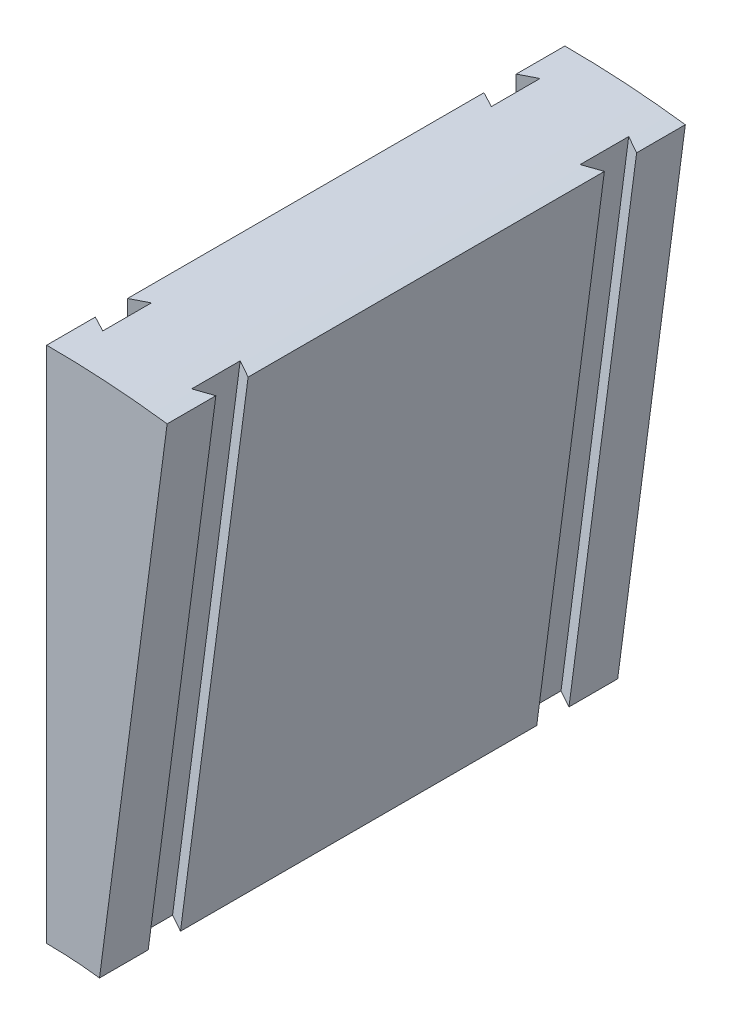
ISO-10303-21;
HEADER;
FILE_DESCRIPTION(('STEP AP214'),'2;1');
FILE_NAME('part.step','',(''),(''),'','','');
FILE_SCHEMA(('AUTOMOTIVE_DESIGN { 1 0 10303 214 1 1 1 1 }'));
ENDSEC;
DATA;
#1=APPLICATION_CONTEXT('core data for automotive mechanical design processes');
#2=APPLICATION_PROTOCOL_DEFINITION('international standard','automotive_design',2000,#1);
#3=PRODUCT_CONTEXT('',#1,'mechanical');
#4=PRODUCT('Part','Part','',(#3));
#5=PRODUCT_RELATED_PRODUCT_CATEGORY('part','',(#4));
#6=PRODUCT_DEFINITION_FORMATION('','',#4);
#7=PRODUCT_DEFINITION_CONTEXT('part definition',#1,'design');
#8=PRODUCT_DEFINITION('design','',#6,#7);
#9=PRODUCT_DEFINITION_SHAPE('','',#8);
#10=(LENGTH_UNIT() NAMED_UNIT(*) SI_UNIT(.MILLI.,.METRE.));
#11=(NAMED_UNIT(*) PLANE_ANGLE_UNIT() SI_UNIT($,.RADIAN.));
#12=(NAMED_UNIT(*) SI_UNIT($,.STERADIAN.) SOLID_ANGLE_UNIT());
#13=UNCERTAINTY_MEASURE_WITH_UNIT(LENGTH_MEASURE(1.E-05),#10,'distance_accuracy_value','');
#14=(GEOMETRIC_REPRESENTATION_CONTEXT(3) GLOBAL_UNCERTAINTY_ASSIGNED_CONTEXT((#13)) GLOBAL_UNIT_ASSIGNED_CONTEXT((#10,
#11,#12)) REPRESENTATION_CONTEXT('',''));
#15=CARTESIAN_POINT('',(0.,0.,0.));
#16=DIRECTION('',(0.,0.,1.));
#17=DIRECTION('',(1.,0.,0.));
#18=AXIS2_PLACEMENT_3D('',#15,#16,#17);
#19=CARTESIAN_POINT('',(0.,79.375,101.6));
#20=DIRECTION('',(1.,0.,0.));
#21=DIRECTION('',(0.,0.,-1.));
#22=AXIS2_PLACEMENT_3D('',#19,#20,#21);
#23=PLANE('',#22);
#24=DIRECTION('',(0.,0.,-1.));
#25=VECTOR('',#24,1.);
#26=CARTESIAN_POINT('',(0.,79.375,101.6));
#27=LINE('',#26,#25);
#28=CARTESIAN_POINT('',(0.,79.375,85.7376210897848));
#29=VERTEX_POINT('',#28);
#30=CARTESIAN_POINT('',(0.,79.375,15.8623789102152));
#31=VERTEX_POINT('',#30);
#32=EDGE_CURVE('E225',#29,#31,#27,.T.);
#33=ORIENTED_EDGE('',*,*,#32,.F.);
#34=DIRECTION('',(0.,-1.,0.));
#35=VECTOR('',#34,1.);
#36=CARTESIAN_POINT('',(0.,180.975,85.7376210897848));
#37=LINE('',#36,#35);
#38=CARTESIAN_POINT('',(0.,180.975,85.7376210897848));
#39=VERTEX_POINT('',#38);
#40=EDGE_CURVE('E190',#39,#29,#37,.T.);
#41=ORIENTED_EDGE('',*,*,#40,.F.);
#42=DIRECTION('',(0.,0.,-1.));
#43=VECTOR('',#42,1.);
#44=CARTESIAN_POINT('',(0.,180.975,101.6));
#45=LINE('',#44,#43);
#46=CARTESIAN_POINT('',(0.,180.975,15.8623789102152));
#47=VERTEX_POINT('',#46);
#48=EDGE_CURVE('E208',#39,#47,#45,.T.);
#49=ORIENTED_EDGE('',*,*,#48,.T.);
#50=DIRECTION('',(0.,-1.,0.));
#51=VECTOR('',#50,1.);
#52=CARTESIAN_POINT('',(0.,180.975,15.8623789102152));
#53=LINE('',#52,#51);
#54=EDGE_CURVE('E348',#47,#31,#53,.T.);
#55=ORIENTED_EDGE('',*,*,#54,.T.);
#56=EDGE_LOOP('',(#33,#41,#49,#55));
#57=FACE_BOUND('',#56,.T.);
#58=ADVANCED_FACE('F43',(#57),#23,.F.);
#59=CARTESIAN_POINT('',(0.,180.975,101.6));
#60=VERTEX_POINT('',#59);
#61=CARTESIAN_POINT('',(0.,180.975,92.0623789102152));
#62=VERTEX_POINT('',#61);
#63=EDGE_CURVE('E198',#60,#62,#45,.T.);
#64=ORIENTED_EDGE('',*,*,#63,.T.);
#65=DIRECTION('',(0.,-1.,0.));
#66=VECTOR('',#65,1.);
#67=CARTESIAN_POINT('',(0.,180.975,92.0623789102152));
#68=LINE('',#67,#66);
#69=CARTESIAN_POINT('',(0.,79.375,92.0623789102152));
#70=VERTEX_POINT('',#69);
#71=EDGE_CURVE('E180',#62,#70,#68,.T.);
#72=ORIENTED_EDGE('',*,*,#71,.T.);
#73=CARTESIAN_POINT('',(0.,79.375,101.6));
#74=VERTEX_POINT('',#73);
#75=EDGE_CURVE('E219',#74,#70,#27,.T.);
#76=ORIENTED_EDGE('',*,*,#75,.F.);
#77=DIRECTION('',(0.,-1.,0.));
#78=VECTOR('',#77,1.);
#79=CARTESIAN_POINT('',(0.,79.375,101.6));
#80=LINE('',#79,#78);
#81=EDGE_CURVE('E205',#60,#74,#80,.T.);
#82=ORIENTED_EDGE('',*,*,#81,.F.);
#83=EDGE_LOOP('',(#64,#72,#76,#82));
#84=FACE_BOUND('',#83,.T.);
#85=ADVANCED_FACE('F204',(#84),#23,.F.);
#86=CARTESIAN_POINT('',(23.6219776370226,179.426733787125,101.6));
#87=DIRECTION('',(-0.991444861373811,0.130526192220045,0.));
#88=DIRECTION('',(-0.130526192220045,-0.991444861373811,0.));
#89=AXIS2_PLACEMENT_3D('',#86,#87,#88);
#90=PLANE('',#89);
#91=DIRECTION('',(0.,0.,-1.));
#92=VECTOR('',#91,1.);
#93=CARTESIAN_POINT('',(10.360516507466,78.6959358715463,101.6));
#94=LINE('',#93,#92);
#95=CARTESIAN_POINT('',(10.360516507466,78.6959358715463,101.6));
#96=VERTEX_POINT('',#95);
#97=CARTESIAN_POINT('',(10.360516507466,78.6959358715463,92.0497578204303));
#98=VERTEX_POINT('',#97);
#99=EDGE_CURVE('E407',#96,#98,#94,.T.);
#100=ORIENTED_EDGE('',*,*,#99,.T.);
#101=DIRECTION('',(-0.130526192220045,-0.991444861373811,0.));
#102=VECTOR('',#101,1.);
#103=CARTESIAN_POINT('',(23.8223380284129,180.948622054056,92.0497578204303));
#104=LINE('',#103,#102);
#105=CARTESIAN_POINT('',(23.6219776370226,179.426733787125,92.0497578204303));
#106=VERTEX_POINT('',#105);
#107=EDGE_CURVE('E289',#106,#98,#104,.T.);
#108=ORIENTED_EDGE('',*,*,#107,.F.);
#109=DIRECTION('',(0.,0.,-1.));
#110=VECTOR('',#109,1.);
#111=CARTESIAN_POINT('',(23.6219776370226,179.426733787125,101.6));
#112=LINE('',#111,#110);
#113=CARTESIAN_POINT('',(23.6219776370226,179.426733787125,101.6));
#114=VERTEX_POINT('',#113);
#115=EDGE_CURVE('E215',#114,#106,#112,.T.);
#116=ORIENTED_EDGE('',*,*,#115,.F.);
#117=DIRECTION('',(0.130526192220045,0.991444861373811,0.));
#118=VECTOR('',#117,1.);
#119=CARTESIAN_POINT('',(23.6219776370226,179.426733787125,101.6));
#120=LINE('',#119,#118);
#121=EDGE_CURVE('E242',#96,#114,#120,.T.);
#122=ORIENTED_EDGE('',*,*,#121,.F.);
#123=EDGE_LOOP('',(#100,#108,#116,#122));
#124=FACE_BOUND('',#123,.T.);
#125=ADVANCED_FACE('F456',(#124),#90,.F.);
#126=CARTESIAN_POINT('',(23.6219776370226,179.426733787126,9.55024217956969));
#127=VERTEX_POINT('',#126);
#128=CARTESIAN_POINT('',(23.6219776370226,179.426733787125,0.));
#129=VERTEX_POINT('',#128);
#130=EDGE_CURVE('E207',#127,#129,#112,.T.);
#131=ORIENTED_EDGE('',*,*,#130,.F.);
#132=DIRECTION('',(-0.130526192220045,-0.991444861373811,0.));
#133=VECTOR('',#132,1.);
#134=CARTESIAN_POINT('',(23.8223380284129,180.948622054056,9.55024217956969));
#135=LINE('',#134,#133);
#136=CARTESIAN_POINT('',(10.360516507466,78.6959358715463,9.55024217956969));
#137=VERTEX_POINT('',#136);
#138=EDGE_CURVE('E290',#127,#137,#135,.T.);
#139=ORIENTED_EDGE('',*,*,#138,.T.);
#140=CARTESIAN_POINT('',(10.360516507466,78.6959358715463,0.));
#141=VERTEX_POINT('',#140);
#142=EDGE_CURVE('E411',#137,#141,#94,.T.);
#143=ORIENTED_EDGE('',*,*,#142,.T.);
#144=DIRECTION('',(0.130526192220045,0.991444861373811,0.));
#145=VECTOR('',#144,1.);
#146=CARTESIAN_POINT('',(23.6219776370226,179.426733787125,0.));
#147=LINE('',#146,#145);
#148=EDGE_CURVE('E249',#141,#129,#147,.T.);
#149=ORIENTED_EDGE('',*,*,#148,.T.);
#150=EDGE_LOOP('',(#131,#139,#143,#149));
#151=FACE_BOUND('',#150,.T.);
#152=ADVANCED_FACE('F436',(#151),#90,.F.);
#153=CARTESIAN_POINT('',(0.,0.,101.6));
#154=DIRECTION('',(0.,0.,-1.));
#155=DIRECTION('',(-1.,0.,0.));
#156=AXIS2_PLACEMENT_3D('',#153,#154,#155);
#157=CYLINDRICAL_SURFACE('',#156,79.375);
#158=DIRECTION('',(0.,0.,-1.));
#159=VECTOR('',#158,1.);
#160=CARTESIAN_POINT('',(3.05991520903345,79.3159980326386,101.6));
#161=LINE('',#160,#159);
#162=CARTESIAN_POINT('',(3.05991520903345,79.3159980326386,93.6625));
#163=VERTEX_POINT('',#162);
#164=CARTESIAN_POINT('',(3.05991520903345,79.3159980326386,84.1375));
#165=VERTEX_POINT('',#164);
#166=EDGE_CURVE('E295',#163,#165,#161,.T.);
#167=ORIENTED_EDGE('',*,*,#166,.T.);
#168=CARTESIAN_POINT('',(0.,0.,85.7376210897848));
#169=DIRECTION('',(-0.46339521326283,0.,-0.8861517230842));
#170=DIRECTION('',(0.8861517230842,0.,-0.46339521326283));
#171=AXIS2_PLACEMENT_3D('',#168,#169,#170);
#172=ELLIPSE('',#171,89.5726972394071,79.375);
#173=EDGE_CURVE('E327',#165,#29,#172,.F.);
#174=ORIENTED_EDGE('',*,*,#173,.T.);
#175=ORIENTED_EDGE('',*,*,#32,.T.);
#176=CARTESIAN_POINT('',(0.,0.,15.8623789102152));
#177=DIRECTION('',(-0.46339521326283,0.,0.8861517230842));
#178=DIRECTION('',(-0.8861517230842,0.,-0.46339521326283));
#179=AXIS2_PLACEMENT_3D('',#176,#177,#178);
#180=ELLIPSE('',#179,89.5726972394071,79.375);
#181=CARTESIAN_POINT('',(3.05991520903345,79.3159980326386,17.4625));
#182=VERTEX_POINT('',#181);
#183=EDGE_CURVE('E202',#31,#182,#180,.F.);
#184=ORIENTED_EDGE('',*,*,#183,.T.);
#185=DIRECTION('',(0.,0.,-1.));
#186=VECTOR('',#185,1.);
#187=CARTESIAN_POINT('',(3.05991520903345,79.3159980326386,101.6));
#188=LINE('',#187,#186);
#189=CARTESIAN_POINT('',(3.05991520903345,79.3159980326387,7.93750000000003));
#190=VERTEX_POINT('',#189);
#191=EDGE_CURVE('E323',#182,#190,#188,.T.);
#192=ORIENTED_EDGE('',*,*,#191,.T.);
#193=CARTESIAN_POINT('',(0.,0.,9.53762108978484));
#194=DIRECTION('',(-0.463395213262817,0.,-0.886151723084207));
#195=DIRECTION('',(0.886151723084207,0.,-0.463395213262817));
#196=AXIS2_PLACEMENT_3D('',#193,#194,#195);
#197=ELLIPSE('',#196,89.5726972394065,79.375);
#198=CARTESIAN_POINT('',(0.,79.375,9.53762108978484));
#199=VERTEX_POINT('',#198);
#200=EDGE_CURVE('E343',#190,#199,#197,.F.);
#201=ORIENTED_EDGE('',*,*,#200,.T.);
#202=CARTESIAN_POINT('',(0.,79.375,0.));
#203=VERTEX_POINT('',#202);
#204=EDGE_CURVE('E226',#199,#203,#27,.T.);
#205=ORIENTED_EDGE('',*,*,#204,.T.);
#206=CARTESIAN_POINT('',(0.,0.,0.));
#207=DIRECTION('',(0.,0.,-1.));
#208=DIRECTION('',(-1.,0.,0.));
#209=AXIS2_PLACEMENT_3D('',#206,#207,#208);
#210=CIRCLE('',#209,79.375);
#211=EDGE_CURVE('E246',#203,#141,#210,.T.);
#212=ORIENTED_EDGE('',*,*,#211,.T.);
#213=ORIENTED_EDGE('',*,*,#142,.F.);
#214=CARTESIAN_POINT('',(0.,0.,9.55024217956969));
#215=DIRECTION('',(0.446200944308673,-0.0587434687440882,-0.893002755974449));
#216=DIRECTION('',(-0.885362993603519,0.116560249379351,-0.450051194667939));
#217=AXIS2_PLACEMENT_3D('',#214,#215,#216);
#218=ELLIPSE('',#217,88.8855039572478,79.375);
#219=CARTESIAN_POINT('',(7.20438734137801,79.0473745802819,7.95012108978485));
#220=VERTEX_POINT('',#219);
#221=EDGE_CURVE('E277',#137,#220,#218,.F.);
#222=ORIENTED_EDGE('',*,*,#221,.T.);
#223=DIRECTION('',(0.,0.,-1.));
#224=VECTOR('',#223,1.);
#225=CARTESIAN_POINT('',(7.20438734137801,79.0473745802819,101.6));
#226=LINE('',#225,#224);
#227=CARTESIAN_POINT('',(7.204387341378,79.0473745802819,17.4751210897849));
#228=VERTEX_POINT('',#227);
#229=EDGE_CURVE('E281',#220,#228,#226,.F.);
#230=ORIENTED_EDGE('',*,*,#229,.T.);
#231=CARTESIAN_POINT('',(0.,0.,15.875));
#232=DIRECTION('',(0.446200944308674,-0.0587434687440883,0.893002755974449));
#233=DIRECTION('',(0.885362993603519,-0.116560249379351,-0.45005119466794));
#234=AXIS2_PLACEMENT_3D('',#231,#232,#233);
#235=ELLIPSE('',#234,88.8855039572477,79.375);
#236=CARTESIAN_POINT('',(10.360516507466,78.6959358715463,15.875));
#237=VERTEX_POINT('',#236);
#238=EDGE_CURVE('E285',#228,#237,#235,.F.);
#239=ORIENTED_EDGE('',*,*,#238,.T.);
#240=CARTESIAN_POINT('',(10.360516507466,78.6959358715463,85.725));
#241=VERTEX_POINT('',#240);
#242=EDGE_CURVE('E410',#241,#237,#94,.T.);
#243=ORIENTED_EDGE('',*,*,#242,.F.);
#244=CARTESIAN_POINT('',(0.,0.,85.725));
#245=DIRECTION('',(0.446200944308674,-0.0587434687440883,-0.893002755974449));
#246=DIRECTION('',(-0.885362993603519,0.116560249379351,-0.45005119466794));
#247=AXIS2_PLACEMENT_3D('',#244,#245,#246);
#248=ELLIPSE('',#247,88.8855039572477,79.375);
#249=CARTESIAN_POINT('',(7.20438734137801,79.0473745802819,84.1248789102151));
#250=VERTEX_POINT('',#249);
#251=EDGE_CURVE('E269',#241,#250,#248,.F.);
#252=ORIENTED_EDGE('',*,*,#251,.T.);
#253=DIRECTION('',(0.,0.,-1.));
#254=VECTOR('',#253,1.);
#255=CARTESIAN_POINT('',(7.204387341378,79.0473745802819,101.6));
#256=LINE('',#255,#254);
#257=CARTESIAN_POINT('',(7.20438734137801,79.0473745802819,93.6498789102152));
#258=VERTEX_POINT('',#257);
#259=EDGE_CURVE('E273',#250,#258,#256,.F.);
#260=ORIENTED_EDGE('',*,*,#259,.T.);
#261=CARTESIAN_POINT('',(0.,0.,92.0497578204303));
#262=DIRECTION('',(0.446200944308673,-0.0587434687440882,0.893002755974449));
#263=DIRECTION('',(0.885362993603519,-0.116560249379351,-0.450051194667939));
#264=AXIS2_PLACEMENT_3D('',#261,#262,#263);
#265=ELLIPSE('',#264,88.8855039572478,79.375);
#266=EDGE_CURVE('E250',#258,#98,#265,.F.);
#267=ORIENTED_EDGE('',*,*,#266,.T.);
#268=ORIENTED_EDGE('',*,*,#99,.F.);
#269=CARTESIAN_POINT('',(0.,0.,101.6));
#270=DIRECTION('',(0.,0.,-1.));
#271=DIRECTION('',(-1.,0.,0.));
#272=AXIS2_PLACEMENT_3D('',#269,#270,#271);
#273=CIRCLE('',#272,79.375);
#274=EDGE_CURVE('E258',#74,#96,#273,.T.);
#275=ORIENTED_EDGE('',*,*,#274,.F.);
#276=ORIENTED_EDGE('',*,*,#75,.T.);
#277=CARTESIAN_POINT('',(0.,0.,92.0623789102152));
#278=DIRECTION('',(-0.463395213262817,0.,0.886151723084207));
#279=DIRECTION('',(-0.886151723084207,0.,-0.463395213262817));
#280=AXIS2_PLACEMENT_3D('',#277,#278,#279);
#281=ELLIPSE('',#280,89.5726972394065,79.375);
#282=EDGE_CURVE('E67',#70,#163,#281,.F.);
#283=ORIENTED_EDGE('',*,*,#282,.T.);
#284=EDGE_LOOP('',(#167,#174,#175,#184,#192,#201,#205,#212,#213,#222,#230,#239,#243,#252,#260,
#267,#268,#275,#276,#283));
#285=FACE_BOUND('',#284,.T.);
#286=ADVANCED_FACE('F45',(#285),#157,.F.);
#287=CARTESIAN_POINT('',(23.6219776370226,179.426733787125,85.725));
#288=VERTEX_POINT('',#287);
#289=CARTESIAN_POINT('',(23.6219776370226,179.426733787125,15.875));
#290=VERTEX_POINT('',#289);
#291=EDGE_CURVE('E213',#288,#290,#112,.T.);
#292=ORIENTED_EDGE('',*,*,#291,.F.);
#293=DIRECTION('',(-0.130526192220045,-0.991444861373811,0.));
#294=VECTOR('',#293,1.);
#295=CARTESIAN_POINT('',(23.8223380284129,180.948622054056,85.725));
#296=LINE('',#295,#294);
#297=EDGE_CURVE('E314',#288,#241,#296,.T.);
#298=ORIENTED_EDGE('',*,*,#297,.T.);
#299=ORIENTED_EDGE('',*,*,#242,.T.);
#300=DIRECTION('',(-0.130526192220045,-0.991444861373811,0.));
#301=VECTOR('',#300,1.);
#302=CARTESIAN_POINT('',(23.8223380284129,180.948622054056,15.875));
#303=LINE('',#302,#301);
#304=EDGE_CURVE('E303',#290,#237,#303,.T.);
#305=ORIENTED_EDGE('',*,*,#304,.F.);
#306=EDGE_LOOP('',(#292,#298,#299,#305));
#307=FACE_BOUND('',#306,.T.);
#308=ADVANCED_FACE('F422',(#307),#90,.F.);
#309=CARTESIAN_POINT('',(0.,0.,101.6));
#310=DIRECTION('',(0.,0.,-1.));
#311=DIRECTION('',(-1.,0.,0.));
#312=AXIS2_PLACEMENT_3D('',#309,#310,#311);
#313=CYLINDRICAL_SURFACE('',#312,180.975);
#314=ORIENTED_EDGE('',*,*,#48,.F.);
#315=CARTESIAN_POINT('',(0.,0.,85.7376210897848));
#316=DIRECTION('',(-0.46339521326283,0.,-0.8861517230842));
#317=DIRECTION('',(0.8861517230842,0.,-0.46339521326283));
#318=AXIS2_PLACEMENT_3D('',#315,#316,#317);
#319=ELLIPSE('',#318,204.225749705848,180.975);
#320=CARTESIAN_POINT('',(3.05991520903345,180.949129713059,84.1375));
#321=VERTEX_POINT('',#320);
#322=EDGE_CURVE('E331',#39,#321,#319,.T.);
#323=ORIENTED_EDGE('',*,*,#322,.T.);
#324=DIRECTION('',(0.,0.,-1.));
#325=VECTOR('',#324,1.);
#326=CARTESIAN_POINT('',(3.05991520903345,180.949129713059,101.6));
#327=LINE('',#326,#325);
#328=CARTESIAN_POINT('',(3.05991520903345,180.949129713059,93.6625));
#329=VERTEX_POINT('',#328);
#330=EDGE_CURVE('E11',#321,#329,#327,.F.);
#331=ORIENTED_EDGE('',*,*,#330,.T.);
#332=CARTESIAN_POINT('',(0.,0.,92.0623789102152));
#333=DIRECTION('',(-0.463395213262817,0.,0.886151723084207));
#334=DIRECTION('',(-0.886151723084207,0.,-0.463395213262817));
#335=AXIS2_PLACEMENT_3D('',#332,#333,#334);
#336=ELLIPSE('',#335,204.225749705847,180.975);
#337=EDGE_CURVE('E183',#329,#62,#336,.T.);
#338=ORIENTED_EDGE('',*,*,#337,.T.);
#339=ORIENTED_EDGE('',*,*,#63,.F.);
#340=CARTESIAN_POINT('',(0.,0.,101.6));
#341=DIRECTION('',(0.,0.,1.));
#342=DIRECTION('',(-1.,0.,0.));
#343=AXIS2_PLACEMENT_3D('',#340,#341,#342);
#344=CIRCLE('',#343,180.975);
#345=EDGE_CURVE('E237',#114,#60,#344,.T.);
#346=ORIENTED_EDGE('',*,*,#345,.F.);
#347=ORIENTED_EDGE('',*,*,#115,.T.);
#348=CARTESIAN_POINT('',(0.,0.,92.0497578204303));
#349=DIRECTION('',(0.446200944308673,-0.0587434687440882,0.893002755974449));
#350=DIRECTION('',(0.885362993603519,-0.116560249379351,-0.450051194667939));
#351=AXIS2_PLACEMENT_3D('',#348,#349,#350);
#352=ELLIPSE('',#351,202.658949022525,180.975);
#353=CARTESIAN_POINT('',(20.4705046534456,179.813539713319,93.6498789102152));
#354=VERTEX_POINT('',#353);
#355=EDGE_CURVE('E382',#106,#354,#352,.T.);
#356=ORIENTED_EDGE('',*,*,#355,.T.);
#357=DIRECTION('',(0.,0.,-1.));
#358=VECTOR('',#357,1.);
#359=CARTESIAN_POINT('',(20.4705046534456,179.813539713319,101.6));
#360=LINE('',#359,#358);
#361=CARTESIAN_POINT('',(20.4705046534456,179.813539713319,84.1248789102151));
#362=VERTEX_POINT('',#361);
#363=EDGE_CURVE('E391',#354,#362,#360,.T.);
#364=ORIENTED_EDGE('',*,*,#363,.T.);
#365=CARTESIAN_POINT('',(0.,0.,85.725));
#366=DIRECTION('',(0.446200944308674,-0.0587434687440883,-0.893002755974449));
#367=DIRECTION('',(-0.885362993603519,0.116560249379351,-0.45005119466794));
#368=AXIS2_PLACEMENT_3D('',#365,#366,#367);
#369=ELLIPSE('',#368,202.658949022525,180.975);
#370=EDGE_CURVE('E385',#362,#288,#369,.T.);
#371=ORIENTED_EDGE('',*,*,#370,.T.);
#372=ORIENTED_EDGE('',*,*,#291,.T.);
#373=CARTESIAN_POINT('',(0.,0.,15.875));
#374=DIRECTION('',(0.446200944308674,-0.0587434687440883,0.893002755974449));
#375=DIRECTION('',(0.885362993603519,-0.116560249379351,-0.45005119466794));
#376=AXIS2_PLACEMENT_3D('',#373,#374,#375);
#377=ELLIPSE('',#376,202.658949022525,180.975);
#378=CARTESIAN_POINT('',(20.4705046534456,179.813539713319,17.4751210897849));
#379=VERTEX_POINT('',#378);
#380=EDGE_CURVE('E403',#290,#379,#377,.T.);
#381=ORIENTED_EDGE('',*,*,#380,.T.);
#382=DIRECTION('',(0.,0.,-1.));
#383=VECTOR('',#382,1.);
#384=CARTESIAN_POINT('',(20.4705046534456,179.813539713319,101.6));
#385=LINE('',#384,#383);
#386=CARTESIAN_POINT('',(20.4705046534456,179.813539713319,7.95012108978485));
#387=VERTEX_POINT('',#386);
#388=EDGE_CURVE('E399',#379,#387,#385,.T.);
#389=ORIENTED_EDGE('',*,*,#388,.T.);
#390=CARTESIAN_POINT('',(0.,0.,9.55024217956969));
#391=DIRECTION('',(0.446200944308673,-0.0587434687440882,-0.893002755974449));
#392=DIRECTION('',(-0.885362993603519,0.116560249379351,-0.450051194667939));
#393=AXIS2_PLACEMENT_3D('',#390,#391,#392);
#394=ELLIPSE('',#393,202.658949022525,180.975);
#395=EDGE_CURVE('E395',#387,#127,#394,.T.);
#396=ORIENTED_EDGE('',*,*,#395,.T.);
#397=ORIENTED_EDGE('',*,*,#130,.T.);
#398=CARTESIAN_POINT('',(0.,0.,0.));
#399=DIRECTION('',(0.,0.,1.));
#400=DIRECTION('',(-1.,0.,0.));
#401=AXIS2_PLACEMENT_3D('',#398,#399,#400);
#402=CIRCLE('',#401,180.975);
#403=CARTESIAN_POINT('',(0.,180.975,0.));
#404=VERTEX_POINT('',#403);
#405=EDGE_CURVE('E254',#129,#404,#402,.T.);
#406=ORIENTED_EDGE('',*,*,#405,.T.);
#407=CARTESIAN_POINT('',(0.,180.975,9.53762108978484));
#408=VERTEX_POINT('',#407);
#409=EDGE_CURVE('E210',#408,#404,#45,.T.);
#410=ORIENTED_EDGE('',*,*,#409,.F.);
#411=CARTESIAN_POINT('',(0.,0.,9.53762108978484));
#412=DIRECTION('',(-0.463395213262817,0.,-0.886151723084207));
#413=DIRECTION('',(0.886151723084207,0.,-0.463395213262817));
#414=AXIS2_PLACEMENT_3D('',#411,#412,#413);
#415=ELLIPSE('',#414,204.225749705847,180.975);
#416=CARTESIAN_POINT('',(3.05991520903345,180.949129713059,7.93750000000003));
#417=VERTEX_POINT('',#416);
#418=EDGE_CURVE('E59',#408,#417,#415,.T.);
#419=ORIENTED_EDGE('',*,*,#418,.T.);
#420=DIRECTION('',(0.,0.,-1.));
#421=VECTOR('',#420,1.);
#422=CARTESIAN_POINT('',(3.05991520903345,180.949129713059,101.6));
#423=LINE('',#422,#421);
#424=CARTESIAN_POINT('',(3.05991520903345,180.949129713059,17.4625));
#425=VERTEX_POINT('',#424);
#426=EDGE_CURVE('E52',#417,#425,#423,.F.);
#427=ORIENTED_EDGE('',*,*,#426,.T.);
#428=CARTESIAN_POINT('',(0.,0.,15.8623789102152));
#429=DIRECTION('',(-0.46339521326283,0.,0.8861517230842));
#430=DIRECTION('',(-0.8861517230842,0.,-0.46339521326283));
#431=AXIS2_PLACEMENT_3D('',#428,#429,#430);
#432=ELLIPSE('',#431,204.225749705848,180.975);
#433=EDGE_CURVE('E339',#425,#47,#432,.T.);
#434=ORIENTED_EDGE('',*,*,#433,.T.);
#435=EDGE_LOOP('',(#314,#323,#331,#338,#339,#346,#347,#356,#364,#371,#372,#381,#389,#396,#397,
#406,#410,#419,#427,#434));
#436=FACE_BOUND('',#435,.T.);
#437=ADVANCED_FACE('F196',(#436),#313,.T.);
#438=ORIENTED_EDGE('',*,*,#204,.F.);
#439=DIRECTION('',(0.,-1.,0.));
#440=VECTOR('',#439,1.);
#441=CARTESIAN_POINT('',(0.,180.975,9.53762108978484));
#442=LINE('',#441,#440);
#443=EDGE_CURVE('E360',#408,#199,#442,.T.);
#444=ORIENTED_EDGE('',*,*,#443,.F.);
#445=ORIENTED_EDGE('',*,*,#409,.T.);
#446=DIRECTION('',(0.,-1.,0.));
#447=VECTOR('',#446,1.);
#448=CARTESIAN_POINT('',(0.,79.375,0.));
#449=LINE('',#448,#447);
#450=EDGE_CURVE('E256',#404,#203,#449,.T.);
#451=ORIENTED_EDGE('',*,*,#450,.T.);
#452=EDGE_LOOP('',(#438,#444,#445,#451));
#453=FACE_BOUND('',#452,.T.);
#454=ADVANCED_FACE('F449',(#453),#23,.F.);
#455=CARTESIAN_POINT('',(0.,0.,101.6));
#456=DIRECTION('',(0.,0.,-1.));
#457=DIRECTION('',(-1.,0.,0.));
#458=AXIS2_PLACEMENT_3D('',#455,#456,#457);
#459=PLANE('',#458);
#460=ORIENTED_EDGE('',*,*,#274,.T.);
#461=ORIENTED_EDGE('',*,*,#121,.T.);
#462=ORIENTED_EDGE('',*,*,#345,.T.);
#463=ORIENTED_EDGE('',*,*,#81,.T.);
#464=EDGE_LOOP('',(#460,#461,#462,#463));
#465=FACE_BOUND('',#464,.T.);
#466=ADVANCED_FACE('F442',(#465),#459,.F.);
#467=CARTESIAN_POINT('',(0.,0.,0.));
#468=DIRECTION('',(0.,0.,-1.));
#469=DIRECTION('',(-1.,0.,0.));
#470=AXIS2_PLACEMENT_3D('',#467,#468,#469);
#471=PLANE('',#470);
#472=ORIENTED_EDGE('',*,*,#211,.F.);
#473=ORIENTED_EDGE('',*,*,#450,.F.);
#474=ORIENTED_EDGE('',*,*,#405,.F.);
#475=ORIENTED_EDGE('',*,*,#148,.F.);
#476=EDGE_LOOP('',(#472,#473,#474,#475));
#477=FACE_BOUND('',#476,.T.);
#478=ADVANCED_FACE('F440',(#477),#471,.T.);
#479=CARTESIAN_POINT('',(20.6745005935511,181.363042714354,7.95012108978485));
#480=DIRECTION('',(0.446200944308673,-0.0587434687440882,-0.893002755974449));
#481=DIRECTION('',(-0.89454753995217,0.,-0.446972816584544));
#482=AXIS2_PLACEMENT_3D('',#479,#480,#481);
#483=PLANE('',#482);
#484=ORIENTED_EDGE('',*,*,#138,.F.);
#485=ORIENTED_EDGE('',*,*,#395,.F.);
#486=DIRECTION('',(-0.130526192220045,-0.991444861373811,0.));
#487=VECTOR('',#486,1.);
#488=CARTESIAN_POINT('',(20.6745005935511,181.363042714354,7.95012108978485));
#489=LINE('',#488,#487);
#490=EDGE_CURVE('E294',#387,#220,#489,.T.);
#491=ORIENTED_EDGE('',*,*,#490,.T.);
#492=ORIENTED_EDGE('',*,*,#221,.F.);
#493=EDGE_LOOP('',(#484,#485,#491,#492));
#494=FACE_BOUND('',#493,.T.);
#495=ADVANCED_FACE('F433',(#494),#483,.F.);
#496=CARTESIAN_POINT('',(20.6745005935511,181.363042714354,7.95012108978485));
#497=DIRECTION('',(-0.991444861373811,0.130526192220045,0.));
#498=DIRECTION('',(-0.130526192220045,-0.991444861373811,0.));
#499=AXIS2_PLACEMENT_3D('',#496,#497,#498);
#500=PLANE('',#499);
#501=ORIENTED_EDGE('',*,*,#490,.F.);
#502=ORIENTED_EDGE('',*,*,#388,.F.);
#503=DIRECTION('',(-0.130526192220045,-0.991444861373811,0.));
#504=VECTOR('',#503,1.);
#505=CARTESIAN_POINT('',(20.6745005935511,181.363042714354,17.4751210897849));
#506=LINE('',#505,#504);
#507=EDGE_CURVE('E299',#379,#228,#506,.T.);
#508=ORIENTED_EDGE('',*,*,#507,.T.);
#509=ORIENTED_EDGE('',*,*,#229,.F.);
#510=EDGE_LOOP('',(#501,#502,#508,#509));
#511=FACE_BOUND('',#510,.T.);
#512=ADVANCED_FACE('F430',(#511),#500,.F.);
#513=CARTESIAN_POINT('',(23.8223380284129,180.948622054056,15.875));
#514=DIRECTION('',(0.446200944308674,-0.0587434687440883,0.893002755974449));
#515=DIRECTION('',(0.89454753995217,0.,-0.446972816584544));
#516=AXIS2_PLACEMENT_3D('',#513,#514,#515);
#517=PLANE('',#516);
#518=ORIENTED_EDGE('',*,*,#507,.F.);
#519=ORIENTED_EDGE('',*,*,#380,.F.);
#520=ORIENTED_EDGE('',*,*,#304,.T.);
#521=ORIENTED_EDGE('',*,*,#238,.F.);
#522=EDGE_LOOP('',(#518,#519,#520,#521));
#523=FACE_BOUND('',#522,.T.);
#524=ADVANCED_FACE('F426',(#523),#517,.F.);
#525=CARTESIAN_POINT('',(20.6745005935511,181.363042714354,93.6498789102152));
#526=DIRECTION('',(0.446200944308673,-0.0587434687440882,0.893002755974449));
#527=DIRECTION('',(0.89454753995217,0.,-0.446972816584544));
#528=AXIS2_PLACEMENT_3D('',#525,#526,#527);
#529=PLANE('',#528);
#530=DIRECTION('',(-0.130526192220045,-0.991444861373811,0.));
#531=VECTOR('',#530,1.);
#532=CARTESIAN_POINT('',(20.6745005935511,181.363042714354,93.6498789102152));
#533=LINE('',#532,#531);
#534=EDGE_CURVE('E306',#354,#258,#533,.T.);
#535=ORIENTED_EDGE('',*,*,#534,.F.);
#536=ORIENTED_EDGE('',*,*,#355,.F.);
#537=ORIENTED_EDGE('',*,*,#107,.T.);
#538=ORIENTED_EDGE('',*,*,#266,.F.);
#539=EDGE_LOOP('',(#535,#536,#537,#538));
#540=FACE_BOUND('',#539,.T.);
#541=ADVANCED_FACE('F479',(#540),#529,.F.);
#542=CARTESIAN_POINT('',(23.8223380284129,180.948622054056,85.725));
#543=DIRECTION('',(0.446200944308674,-0.0587434687440883,-0.893002755974449));
#544=DIRECTION('',(-0.89454753995217,0.,-0.446972816584544));
#545=AXIS2_PLACEMENT_3D('',#542,#543,#544);
#546=PLANE('',#545);
#547=ORIENTED_EDGE('',*,*,#297,.F.);
#548=ORIENTED_EDGE('',*,*,#370,.F.);
#549=DIRECTION('',(-0.130526192220045,-0.991444861373811,0.));
#550=VECTOR('',#549,1.);
#551=CARTESIAN_POINT('',(20.6745005935511,181.363042714354,84.1248789102151));
#552=LINE('',#551,#550);
#553=EDGE_CURVE('E310',#362,#250,#552,.T.);
#554=ORIENTED_EDGE('',*,*,#553,.T.);
#555=ORIENTED_EDGE('',*,*,#251,.F.);
#556=EDGE_LOOP('',(#547,#548,#554,#555));
#557=FACE_BOUND('',#556,.T.);
#558=ADVANCED_FACE('F472',(#557),#546,.F.);
#559=CARTESIAN_POINT('',(20.6745005935511,181.363042714354,93.6498789102152));
#560=DIRECTION('',(-0.991444861373811,0.130526192220045,0.));
#561=DIRECTION('',(-0.130526192220045,-0.991444861373811,0.));
#562=AXIS2_PLACEMENT_3D('',#559,#560,#561);
#563=PLANE('',#562);
#564=ORIENTED_EDGE('',*,*,#553,.F.);
#565=ORIENTED_EDGE('',*,*,#363,.F.);
#566=ORIENTED_EDGE('',*,*,#534,.T.);
#567=ORIENTED_EDGE('',*,*,#259,.F.);
#568=EDGE_LOOP('',(#564,#565,#566,#567));
#569=FACE_BOUND('',#568,.T.);
#570=ADVANCED_FACE('F465',(#569),#563,.F.);
#571=CARTESIAN_POINT('',(3.05991520903345,180.975,17.4625));
#572=DIRECTION('',(1.,0.,0.));
#573=DIRECTION('',(0.,0.,-1.));
#574=AXIS2_PLACEMENT_3D('',#571,#572,#573);
#575=PLANE('',#574);
#576=DIRECTION('',(0.,-1.,0.));
#577=VECTOR('',#576,1.);
#578=CARTESIAN_POINT('',(3.05991520903345,180.975,17.4625));
#579=LINE('',#578,#577);
#580=EDGE_CURVE('E352',#425,#182,#579,.T.);
#581=ORIENTED_EDGE('',*,*,#580,.F.);
#582=ORIENTED_EDGE('',*,*,#426,.F.);
#583=DIRECTION('',(0.,-1.,0.));
#584=VECTOR('',#583,1.);
#585=CARTESIAN_POINT('',(3.05991520903345,180.975,7.93750000000003));
#586=LINE('',#585,#584);
#587=EDGE_CURVE('E356',#417,#190,#586,.T.);
#588=ORIENTED_EDGE('',*,*,#587,.T.);
#589=ORIENTED_EDGE('',*,*,#191,.F.);
#590=EDGE_LOOP('',(#581,#582,#588,#589));
#591=FACE_BOUND('',#590,.T.);
#592=ADVANCED_FACE('F463',(#591),#575,.F.);
#593=CARTESIAN_POINT('',(0.,180.975,15.8623789102152));
#594=DIRECTION('',(-0.46339521326283,0.,0.8861517230842));
#595=DIRECTION('',(0.8861517230842,0.,0.46339521326283));
#596=AXIS2_PLACEMENT_3D('',#593,#594,#595);
#597=PLANE('',#596);
#598=ORIENTED_EDGE('',*,*,#54,.F.);
#599=ORIENTED_EDGE('',*,*,#433,.F.);
#600=ORIENTED_EDGE('',*,*,#580,.T.);
#601=ORIENTED_EDGE('',*,*,#183,.F.);
#602=EDGE_LOOP('',(#598,#599,#600,#601));
#603=FACE_BOUND('',#602,.T.);
#604=ADVANCED_FACE('F377',(#603),#597,.F.);
#605=CARTESIAN_POINT('',(3.05991520903345,180.975,7.93750000000003));
#606=DIRECTION('',(-0.463395213262817,0.,-0.886151723084207));
#607=DIRECTION('',(-0.886151723084207,0.,0.463395213262817));
#608=AXIS2_PLACEMENT_3D('',#605,#606,#607);
#609=PLANE('',#608);
#610=ORIENTED_EDGE('',*,*,#587,.F.);
#611=ORIENTED_EDGE('',*,*,#418,.F.);
#612=ORIENTED_EDGE('',*,*,#443,.T.);
#613=ORIENTED_EDGE('',*,*,#200,.F.);
#614=EDGE_LOOP('',(#610,#611,#612,#613));
#615=FACE_BOUND('',#614,.T.);
#616=ADVANCED_FACE('F462',(#615),#609,.F.);
#617=CARTESIAN_POINT('',(3.05991520903345,180.975,84.1375));
#618=DIRECTION('',(1.,0.,0.));
#619=DIRECTION('',(0.,0.,-1.));
#620=AXIS2_PLACEMENT_3D('',#617,#618,#619);
#621=PLANE('',#620);
#622=DIRECTION('',(0.,-1.,0.));
#623=VECTOR('',#622,1.);
#624=CARTESIAN_POINT('',(3.05991520903345,180.975,93.6625));
#625=LINE('',#624,#623);
#626=EDGE_CURVE('E191',#329,#163,#625,.T.);
#627=ORIENTED_EDGE('',*,*,#626,.F.);
#628=ORIENTED_EDGE('',*,*,#330,.F.);
#629=DIRECTION('',(0.,-1.,0.));
#630=VECTOR('',#629,1.);
#631=CARTESIAN_POINT('',(3.05991520903345,180.975,84.1375));
#632=LINE('',#631,#630);
#633=EDGE_CURVE('E363',#321,#165,#632,.T.);
#634=ORIENTED_EDGE('',*,*,#633,.T.);
#635=ORIENTED_EDGE('',*,*,#166,.F.);
#636=EDGE_LOOP('',(#627,#628,#634,#635));
#637=FACE_BOUND('',#636,.T.);
#638=ADVANCED_FACE('F566',(#637),#621,.F.);
#639=CARTESIAN_POINT('',(0.,180.975,85.7376210897848));
#640=DIRECTION('',(-0.46339521326283,0.,-0.8861517230842));
#641=DIRECTION('',(-0.8861517230842,0.,0.46339521326283));
#642=AXIS2_PLACEMENT_3D('',#639,#640,#641);
#643=PLANE('',#642);
#644=ORIENTED_EDGE('',*,*,#633,.F.);
#645=ORIENTED_EDGE('',*,*,#322,.F.);
#646=ORIENTED_EDGE('',*,*,#40,.T.);
#647=ORIENTED_EDGE('',*,*,#173,.F.);
#648=EDGE_LOOP('',(#644,#645,#646,#647));
#649=FACE_BOUND('',#648,.T.);
#650=ADVANCED_FACE('F373',(#649),#643,.F.);
#651=CARTESIAN_POINT('',(3.05991520903345,180.975,93.6625));
#652=DIRECTION('',(-0.463395213262817,0.,0.886151723084207));
#653=DIRECTION('',(0.886151723084207,0.,0.463395213262817));
#654=AXIS2_PLACEMENT_3D('',#651,#652,#653);
#655=PLANE('',#654);
#656=ORIENTED_EDGE('',*,*,#71,.F.);
#657=ORIENTED_EDGE('',*,*,#337,.F.);
#658=ORIENTED_EDGE('',*,*,#626,.T.);
#659=ORIENTED_EDGE('',*,*,#282,.F.);
#660=EDGE_LOOP('',(#656,#657,#658,#659));
#661=FACE_BOUND('',#660,.T.);
#662=ADVANCED_FACE('F182',(#661),#655,.F.);
#663=CLOSED_SHELL('',(#58,#85,#125,#152,#286,#308,#437,#454,#466,#478,#495,#512,#524,#541,#558,
#570,#592,#604,#616,#638,#650,#662));
#664=MANIFOLD_SOLID_BREP('B2',#663);
#665=ADVANCED_BREP_SHAPE_REPRESENTATION('',(#18,#664),#14);
#666=SHAPE_DEFINITION_REPRESENTATION(#9,#665);
ENDSEC;
END-ISO-10303-21;
